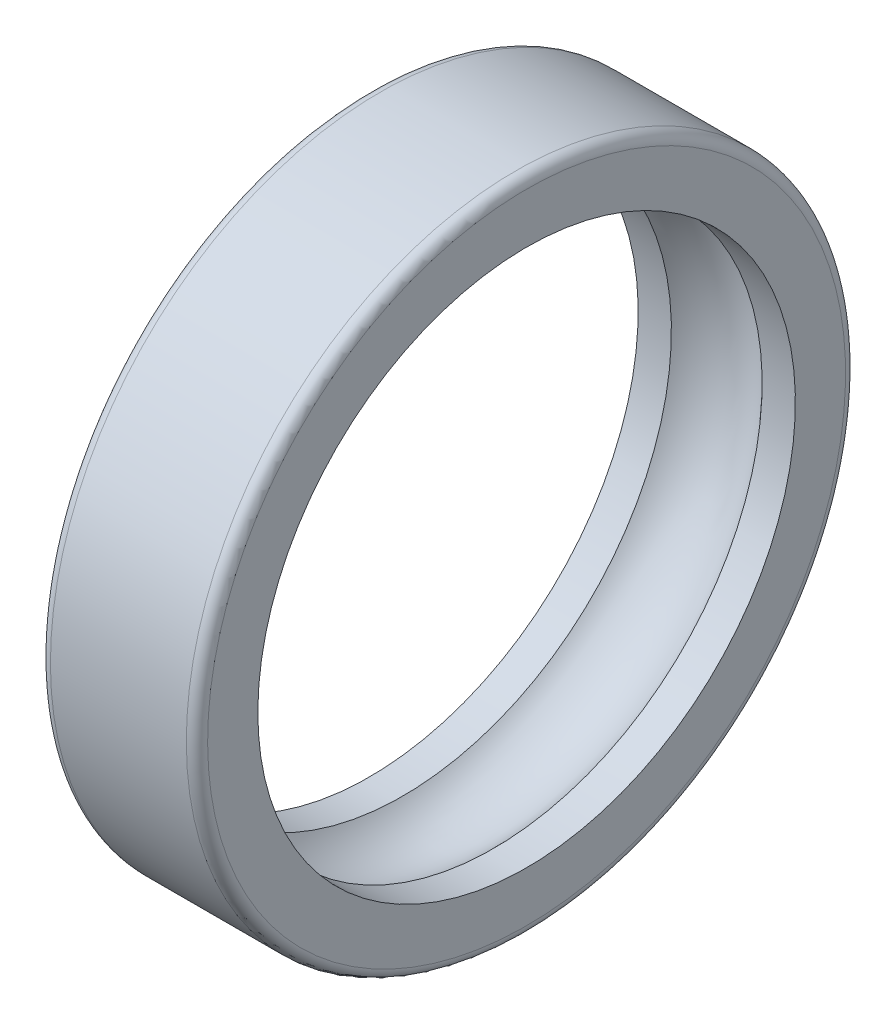
ISO-10303-21;
HEADER;
FILE_DESCRIPTION(('STEP AP214'),'2;1');
FILE_NAME('part.step','',(''),(''),'','','');
FILE_SCHEMA(('AUTOMOTIVE_DESIGN { 1 0 10303 214 1 1 1 1 }'));
ENDSEC;
DATA;
#1=APPLICATION_CONTEXT('core data for automotive mechanical design processes');
#2=APPLICATION_PROTOCOL_DEFINITION('international standard','automotive_design',2000,#1);
#3=PRODUCT_CONTEXT('',#1,'mechanical');
#4=PRODUCT('Part','Part','',(#3));
#5=PRODUCT_RELATED_PRODUCT_CATEGORY('part','',(#4));
#6=PRODUCT_DEFINITION_FORMATION('','',#4);
#7=PRODUCT_DEFINITION_CONTEXT('part definition',#1,'design');
#8=PRODUCT_DEFINITION('design','',#6,#7);
#9=PRODUCT_DEFINITION_SHAPE('','',#8);
#10=(LENGTH_UNIT() NAMED_UNIT(*) SI_UNIT(.MILLI.,.METRE.));
#11=(NAMED_UNIT(*) PLANE_ANGLE_UNIT() SI_UNIT($,.RADIAN.));
#12=(NAMED_UNIT(*) SI_UNIT($,.STERADIAN.) SOLID_ANGLE_UNIT());
#13=UNCERTAINTY_MEASURE_WITH_UNIT(LENGTH_MEASURE(1.E-05),#10,'distance_accuracy_value','');
#14=(GEOMETRIC_REPRESENTATION_CONTEXT(3) GLOBAL_UNCERTAINTY_ASSIGNED_CONTEXT((#13)) GLOBAL_UNIT_ASSIGNED_CONTEXT((#10,
#11,#12)) REPRESENTATION_CONTEXT('',''));
#15=CARTESIAN_POINT('',(0.,0.,0.));
#16=DIRECTION('',(0.,0.,1.));
#17=DIRECTION('',(1.,0.,0.));
#18=AXIS2_PLACEMENT_3D('',#15,#16,#17);
#19=CARTESIAN_POINT('',(24.2082927418299,93.2091861434946,101.931940707821));
#20=DIRECTION('',(-1.,0.,0.));
#21=DIRECTION('',(0.,-0.144957338509459,0.989437906092269));
#22=AXIS2_PLACEMENT_3D('',#19,#20,#21);
#23=CYLINDRICAL_SURFACE('',#22,5.707464);
#24=CARTESIAN_POINT('',(27.2568415328049,93.2091861434946,101.931940707821));
#25=DIRECTION('',(-1.,0.,0.));
#26=DIRECTION('',(0.,-0.144957338509459,0.989437906092269));
#27=AXIS2_PLACEMENT_3D('',#24,#25,#26);
#28=CIRCLE('',#27,5.707464);
#29=CARTESIAN_POINT('',(27.2568415328049,92.3818473524161,107.579121937078));
#30=VERTEX_POINT('',#29);
#31=EDGE_CURVE('E122',#30,#30,#28,.T.);
#32=ORIENTED_EDGE('',*,*,#31,.F.);
#33=EDGE_LOOP('',(#32));
#34=FACE_BOUND('',#33,.T.);
#35=CARTESIAN_POINT('',(26.5508682862489,93.2091861434946,101.931940707821));
#36=DIRECTION('',(-1.,0.,0.));
#37=DIRECTION('',(0.,-0.144957338509459,0.989437906092269));
#38=AXIS2_PLACEMENT_3D('',#35,#36,#37);
#39=CIRCLE('',#38,5.707464);
#40=CARTESIAN_POINT('',(26.5508682862489,92.3818473524161,107.579121937078));
#41=VERTEX_POINT('',#40);
#42=EDGE_CURVE('E72',#41,#41,#39,.T.);
#43=ORIENTED_EDGE('',*,*,#42,.T.);
#44=EDGE_LOOP('',(#43));
#45=FACE_BOUND('',#44,.T.);
#46=ADVANCED_FACE('F44',(#34,#45),#23,.F.);
#47=CARTESIAN_POINT('',(25.5876775328049,93.2091861434946,101.931940707821));
#48=DIRECTION('',(-1.,0.,0.));
#49=DIRECTION('',(0.,-0.144957338509459,0.989437906092269));
#50=AXIS2_PLACEMENT_3D('',#47,#48,#49);
#51=TOROIDAL_SURFACE('',#50,4.84596,1.292256);
#52=ORIENTED_EDGE('',*,*,#42,.F.);
#53=EDGE_LOOP('',(#52));
#54=FACE_BOUND('',#53,.T.);
#55=CARTESIAN_POINT('',(24.6244867793609,93.2091861434946,101.931940707821));
#56=DIRECTION('',(-1.,0.,0.));
#57=DIRECTION('',(0.,-0.144957338509459,0.989437906092269));
#58=AXIS2_PLACEMENT_3D('',#55,#56,#57);
#59=CIRCLE('',#58,5.707464);
#60=CARTESIAN_POINT('',(24.6244867793609,92.3818473524161,107.579121937078));
#61=VERTEX_POINT('',#60);
#62=EDGE_CURVE('E68',#61,#61,#59,.T.);
#63=ORIENTED_EDGE('',*,*,#62,.T.);
#64=EDGE_LOOP('',(#63));
#65=FACE_BOUND('',#64,.T.);
#66=ADVANCED_FACE('F95',(#54,#65),#51,.F.);
#67=CARTESIAN_POINT('',(24.2082927418299,93.2091861434946,101.931940707821));
#68=DIRECTION('',(-1.,0.,0.));
#69=DIRECTION('',(0.,-0.144957338509459,0.989437906092269));
#70=AXIS2_PLACEMENT_3D('',#67,#68,#69);
#71=CYLINDRICAL_SURFACE('',#70,5.707464);
#72=ORIENTED_EDGE('',*,*,#62,.F.);
#73=EDGE_LOOP('',(#72));
#74=FACE_BOUND('',#73,.T.);
#75=CARTESIAN_POINT('',(23.9185135328049,93.2091861434946,101.931940707821));
#76=DIRECTION('',(-1.,0.,0.));
#77=DIRECTION('',(0.,-0.144957338509459,0.989437906092269));
#78=AXIS2_PLACEMENT_3D('',#75,#76,#77);
#79=CIRCLE('',#78,5.707464);
#80=CARTESIAN_POINT('',(23.9185135328049,92.3818473524161,107.579121937078));
#81=VERTEX_POINT('',#80);
#82=EDGE_CURVE('E73',#81,#81,#79,.T.);
#83=ORIENTED_EDGE('',*,*,#82,.T.);
#84=EDGE_LOOP('',(#83));
#85=FACE_BOUND('',#84,.T.);
#86=ADVANCED_FACE('F102',(#74,#85),#71,.F.);
#87=CARTESIAN_POINT('',(23.9185135328049,100.134974443527,102.946601489333));
#88=DIRECTION('',(1.,0.,0.));
#89=DIRECTION('',(0.,0.144957338509459,-0.989437906092269));
#90=AXIS2_PLACEMENT_3D('',#87,#88,#89);
#91=PLANE('',#90);
#92=CARTESIAN_POINT('',(23.9185135328049,93.2091861434946,101.931940707821));
#93=DIRECTION('',(1.,0.,0.));
#94=DIRECTION('',(0.,0.144957338509459,-0.989437906092269));
#95=AXIS2_PLACEMENT_3D('',#92,#93,#94);
#96=CIRCLE('',#95,6.7735752);
#97=CARTESIAN_POINT('',(23.9185135328049,94.1910655766803,95.229908645175));
#98=VERTEX_POINT('',#97);
#99=EDGE_CURVE('E11',#98,#98,#96,.F.);
#100=ORIENTED_EDGE('',*,*,#99,.T.);
#101=EDGE_LOOP('',(#100));
#102=FACE_BOUND('',#101,.T.);
#103=ORIENTED_EDGE('',*,*,#82,.F.);
#104=EDGE_LOOP('',(#103));
#105=FACE_BOUND('',#104,.T.);
#106=ADVANCED_FACE('F109',(#102,#105),#91,.F.);
#107=CARTESIAN_POINT('',(24.2082927418299,93.2091861434946,101.931940707821));
#108=DIRECTION('',(-1.,0.,0.));
#109=DIRECTION('',(0.,-0.144957338509459,0.989437906092269));
#110=AXIS2_PLACEMENT_3D('',#107,#108,#109);
#111=CYLINDRICAL_SURFACE('',#110,6.99972);
#112=CARTESIAN_POINT('',(27.0306967328049,93.2091861434946,101.931940707821));
#113=DIRECTION('',(-1.,0.,0.));
#114=DIRECTION('',(0.,-0.144957338509459,0.989437906092269));
#115=AXIS2_PLACEMENT_3D('',#112,#113,#114);
#116=CIRCLE('',#115,6.99972);
#117=CARTESIAN_POINT('',(27.0306967328049,92.1945253619832,108.857729007854));
#118=VERTEX_POINT('',#117);
#119=EDGE_CURVE('E55',#118,#118,#116,.T.);
#120=ORIENTED_EDGE('',*,*,#119,.T.);
#121=EDGE_LOOP('',(#120));
#122=FACE_BOUND('',#121,.T.);
#123=CARTESIAN_POINT('',(24.1446583328049,93.2091861434946,101.931940707821));
#124=DIRECTION('',(1.,0.,0.));
#125=DIRECTION('',(0.,0.144957338509459,-0.989437906092269));
#126=AXIS2_PLACEMENT_3D('',#123,#124,#125);
#127=CIRCLE('',#126,6.99972);
#128=CARTESIAN_POINT('',(24.1446583328049,94.2238469250061,95.0061524077893));
#129=VERTEX_POINT('',#128);
#130=EDGE_CURVE('E59',#129,#129,#127,.T.);
#131=ORIENTED_EDGE('',*,*,#130,.T.);
#132=EDGE_LOOP('',(#131));
#133=FACE_BOUND('',#132,.T.);
#134=ADVANCED_FACE('F83',(#122,#133),#111,.T.);
#135=CARTESIAN_POINT('',(27.2568415328049,100.134974443527,102.946601489333));
#136=DIRECTION('',(-1.,0.,0.));
#137=DIRECTION('',(0.,-0.144957338509459,0.989437906092269));
#138=AXIS2_PLACEMENT_3D('',#135,#136,#137);
#139=PLANE('',#138);
#140=CARTESIAN_POINT('',(27.2568415328049,93.2091861434946,101.931940707821));
#141=DIRECTION('',(-1.,0.,0.));
#142=DIRECTION('',(0.,-0.144957338509459,0.989437906092269));
#143=AXIS2_PLACEMENT_3D('',#140,#141,#142);
#144=CIRCLE('',#143,6.7735752);
#145=CARTESIAN_POINT('',(27.2568415328049,92.227306710309,108.633972770468));
#146=VERTEX_POINT('',#145);
#147=EDGE_CURVE('E51',#146,#146,#144,.F.);
#148=ORIENTED_EDGE('',*,*,#147,.T.);
#149=EDGE_LOOP('',(#148));
#150=FACE_BOUND('',#149,.T.);
#151=ORIENTED_EDGE('',*,*,#31,.T.);
#152=EDGE_LOOP('',(#151));
#153=FACE_BOUND('',#152,.T.);
#154=ADVANCED_FACE('F92',(#150,#153),#139,.F.);
#155=CARTESIAN_POINT('',(27.0306967328049,93.2091861434946,101.931940707821));
#156=DIRECTION('',(-1.,0.,0.));
#157=DIRECTION('',(0.,-0.144957338509459,0.989437906092269));
#158=AXIS2_PLACEMENT_3D('',#155,#156,#157);
#159=TOROIDAL_SURFACE('',#158,6.7735752,0.2261448);
#160=ORIENTED_EDGE('',*,*,#147,.F.);
#161=EDGE_LOOP('',(#160));
#162=FACE_BOUND('',#161,.T.);
#163=ORIENTED_EDGE('',*,*,#119,.F.);
#164=EDGE_LOOP('',(#163));
#165=FACE_BOUND('',#164,.T.);
#166=ADVANCED_FACE('F87',(#162,#165),#159,.T.);
#167=CARTESIAN_POINT('',(24.1446583328049,93.2091861434946,101.931940707821));
#168=DIRECTION('',(1.,0.,0.));
#169=DIRECTION('',(0.,0.144957338509459,-0.989437906092269));
#170=AXIS2_PLACEMENT_3D('',#167,#168,#169);
#171=TOROIDAL_SURFACE('',#170,6.7735752,0.2261448);
#172=ORIENTED_EDGE('',*,*,#130,.F.);
#173=EDGE_LOOP('',(#172));
#174=FACE_BOUND('',#173,.T.);
#175=ORIENTED_EDGE('',*,*,#99,.F.);
#176=EDGE_LOOP('',(#175));
#177=FACE_BOUND('',#176,.T.);
#178=ADVANCED_FACE('F46',(#174,#177),#171,.T.);
#179=CLOSED_SHELL('',(#46,#66,#86,#106,#134,#154,#166,#178));
#180=MANIFOLD_SOLID_BREP('B2',#179);
#181=ADVANCED_BREP_SHAPE_REPRESENTATION('',(#18,#180),#14);
#182=SHAPE_DEFINITION_REPRESENTATION(#9,#181);
ENDSEC;
END-ISO-10303-21;
